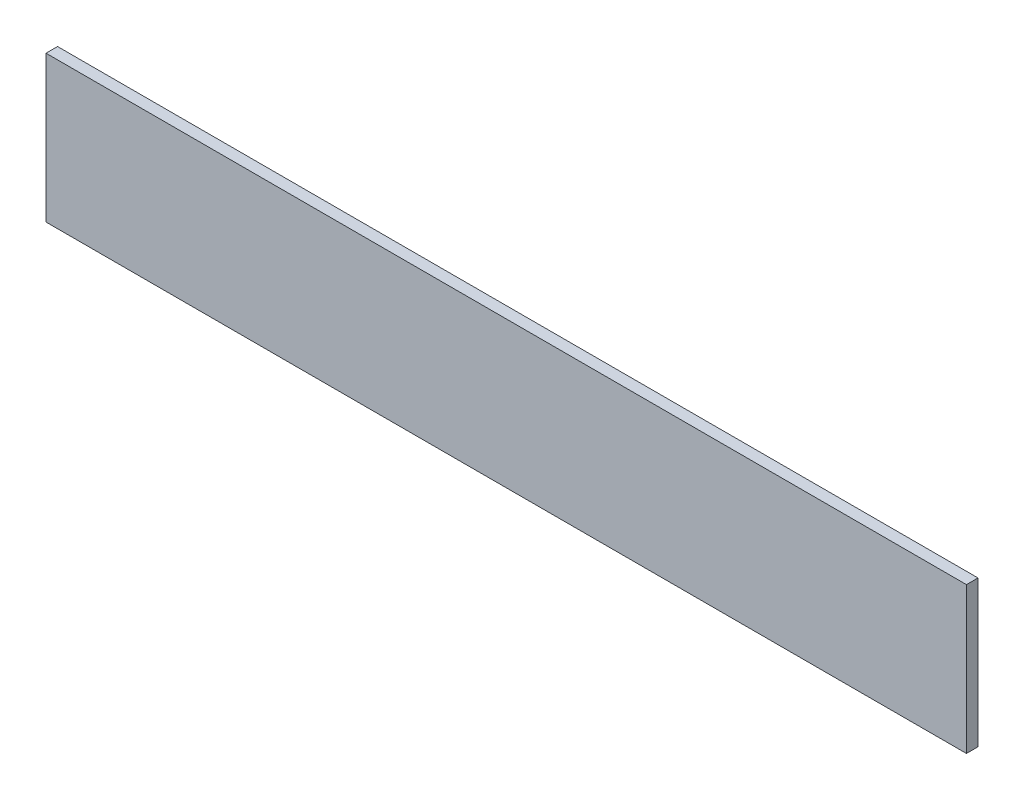
ISO-10303-21;
HEADER;
FILE_DESCRIPTION(('STEP AP214'),'2;1');
FILE_NAME('part.step','',(''),(''),'','','');
FILE_SCHEMA(('AUTOMOTIVE_DESIGN { 1 0 10303 214 1 1 1 1 }'));
ENDSEC;
DATA;
#1=APPLICATION_CONTEXT('core data for automotive mechanical design processes');
#2=APPLICATION_PROTOCOL_DEFINITION('international standard','automotive_design',2000,#1);
#3=PRODUCT_CONTEXT('',#1,'mechanical');
#4=PRODUCT('Part','Part','',(#3));
#5=PRODUCT_RELATED_PRODUCT_CATEGORY('part','',(#4));
#6=PRODUCT_DEFINITION_FORMATION('','',#4);
#7=PRODUCT_DEFINITION_CONTEXT('part definition',#1,'design');
#8=PRODUCT_DEFINITION('design','',#6,#7);
#9=PRODUCT_DEFINITION_SHAPE('','',#8);
#10=(LENGTH_UNIT() NAMED_UNIT(*) SI_UNIT(.MILLI.,.METRE.));
#11=(NAMED_UNIT(*) PLANE_ANGLE_UNIT() SI_UNIT($,.RADIAN.));
#12=(NAMED_UNIT(*) SI_UNIT($,.STERADIAN.) SOLID_ANGLE_UNIT());
#13=UNCERTAINTY_MEASURE_WITH_UNIT(LENGTH_MEASURE(1.E-05),#10,'distance_accuracy_value','');
#14=(GEOMETRIC_REPRESENTATION_CONTEXT(3) GLOBAL_UNCERTAINTY_ASSIGNED_CONTEXT((#13)) GLOBAL_UNIT_ASSIGNED_CONTEXT((#10,
#11,#12)) REPRESENTATION_CONTEXT('',''));
#15=CARTESIAN_POINT('',(0.,0.,0.));
#16=DIRECTION('',(0.,0.,1.));
#17=DIRECTION('',(1.,0.,0.));
#18=AXIS2_PLACEMENT_3D('',#15,#16,#17);
#19=CARTESIAN_POINT('',(-16.11,9.67288461538461,-11.2));
#20=DIRECTION('',(-1.,0.,0.));
#21=DIRECTION('',(0.,-1.,0.));
#22=AXIS2_PLACEMENT_3D('',#19,#20,#21);
#23=PLANE('',#22);
#24=DIRECTION('',(0.,-1.,0.));
#25=VECTOR('',#24,1.);
#26=CARTESIAN_POINT('',(-16.11,9.67288461538461,0.));
#27=LINE('',#26,#25);
#28=CARTESIAN_POINT('',(-16.11,9.67288461538461,0.));
#29=VERTEX_POINT('',#28);
#30=CARTESIAN_POINT('',(-16.11,-132.059115384615,0.));
#31=VERTEX_POINT('',#30);
#32=EDGE_CURVE('E113',#29,#31,#27,.T.);
#33=ORIENTED_EDGE('',*,*,#32,.F.);
#34=DIRECTION('',(0.,0.,1.));
#35=VECTOR('',#34,1.);
#36=CARTESIAN_POINT('',(-16.11,9.67288461538461,-11.2));
#37=LINE('',#36,#35);
#38=CARTESIAN_POINT('',(-16.11,9.67288461538461,-11.2));
#39=VERTEX_POINT('',#38);
#40=EDGE_CURVE('E11',#39,#29,#37,.T.);
#41=ORIENTED_EDGE('',*,*,#40,.F.);
#42=DIRECTION('',(0.,-1.,0.));
#43=VECTOR('',#42,1.);
#44=CARTESIAN_POINT('',(-16.11,9.67288461538461,-11.2));
#45=LINE('',#44,#43);
#46=CARTESIAN_POINT('',(-16.11,-132.059115384615,-11.2));
#47=VERTEX_POINT('',#46);
#48=EDGE_CURVE('E105',#39,#47,#45,.T.);
#49=ORIENTED_EDGE('',*,*,#48,.T.);
#50=DIRECTION('',(0.,0.,1.));
#51=VECTOR('',#50,1.);
#52=CARTESIAN_POINT('',(-16.11,-132.059115384615,-11.2));
#53=LINE('',#52,#51);
#54=EDGE_CURVE('E46',#47,#31,#53,.T.);
#55=ORIENTED_EDGE('',*,*,#54,.T.);
#56=EDGE_LOOP('',(#33,#41,#49,#55));
#57=FACE_BOUND('',#56,.T.);
#58=ADVANCED_FACE('F43',(#57),#23,.T.);
#59=CARTESIAN_POINT('',(-16.11,9.67288461538461,-11.2));
#60=DIRECTION('',(0.,1.,0.));
#61=DIRECTION('',(0.,0.,1.));
#62=AXIS2_PLACEMENT_3D('',#59,#60,#61);
#63=PLANE('',#62);
#64=DIRECTION('',(-1.,0.,0.));
#65=VECTOR('',#64,1.);
#66=CARTESIAN_POINT('',(-16.11,9.67288461538461,0.));
#67=LINE('',#66,#65);
#68=CARTESIAN_POINT('',(875.89,9.67288461538461,0.));
#69=VERTEX_POINT('',#68);
#70=EDGE_CURVE('E108',#69,#29,#67,.T.);
#71=ORIENTED_EDGE('',*,*,#70,.F.);
#72=DIRECTION('',(0.,0.,1.));
#73=VECTOR('',#72,1.);
#74=CARTESIAN_POINT('',(875.89,9.67288461538461,-11.2));
#75=LINE('',#74,#73);
#76=CARTESIAN_POINT('',(875.89,9.67288461538461,-11.2));
#77=VERTEX_POINT('',#76);
#78=EDGE_CURVE('E53',#77,#69,#75,.T.);
#79=ORIENTED_EDGE('',*,*,#78,.F.);
#80=DIRECTION('',(-1.,0.,0.));
#81=VECTOR('',#80,1.);
#82=CARTESIAN_POINT('',(-16.11,9.67288461538461,-11.2));
#83=LINE('',#82,#81);
#84=EDGE_CURVE('E100',#77,#39,#83,.T.);
#85=ORIENTED_EDGE('',*,*,#84,.T.);
#86=ORIENTED_EDGE('',*,*,#40,.T.);
#87=EDGE_LOOP('',(#71,#79,#85,#86));
#88=FACE_BOUND('',#87,.T.);
#89=ADVANCED_FACE('F129',(#88),#63,.T.);
#90=CARTESIAN_POINT('',(875.89,9.67288461538461,-11.2));
#91=DIRECTION('',(1.,0.,0.));
#92=DIRECTION('',(0.,0.,-1.));
#93=AXIS2_PLACEMENT_3D('',#90,#91,#92);
#94=PLANE('',#93);
#95=DIRECTION('',(0.,1.,0.));
#96=VECTOR('',#95,1.);
#97=CARTESIAN_POINT('',(875.89,9.67288461538461,0.));
#98=LINE('',#97,#96);
#99=CARTESIAN_POINT('',(875.89,-132.059115384615,0.));
#100=VERTEX_POINT('',#99);
#101=EDGE_CURVE('E94',#100,#69,#98,.T.);
#102=ORIENTED_EDGE('',*,*,#101,.F.);
#103=DIRECTION('',(0.,0.,1.));
#104=VECTOR('',#103,1.);
#105=CARTESIAN_POINT('',(875.89,-132.059115384615,-11.2));
#106=LINE('',#105,#104);
#107=CARTESIAN_POINT('',(875.89,-132.059115384615,-11.2));
#108=VERTEX_POINT('',#107);
#109=EDGE_CURVE('E89',#108,#100,#106,.T.);
#110=ORIENTED_EDGE('',*,*,#109,.F.);
#111=DIRECTION('',(0.,1.,0.));
#112=VECTOR('',#111,1.);
#113=CARTESIAN_POINT('',(875.89,9.67288461538461,-11.2));
#114=LINE('',#113,#112);
#115=EDGE_CURVE('E92',#108,#77,#114,.T.);
#116=ORIENTED_EDGE('',*,*,#115,.T.);
#117=ORIENTED_EDGE('',*,*,#78,.T.);
#118=EDGE_LOOP('',(#102,#110,#116,#117));
#119=FACE_BOUND('',#118,.T.);
#120=ADVANCED_FACE('F91',(#119),#94,.T.);
#121=CARTESIAN_POINT('',(-16.11,-132.059115384615,-11.2));
#122=DIRECTION('',(0.,-1.,0.));
#123=DIRECTION('',(0.,0.,-1.));
#124=AXIS2_PLACEMENT_3D('',#121,#122,#123);
#125=PLANE('',#124);
#126=DIRECTION('',(1.,0.,0.));
#127=VECTOR('',#126,1.);
#128=CARTESIAN_POINT('',(-16.11,-132.059115384615,0.));
#129=LINE('',#128,#127);
#130=EDGE_CURVE('E117',#31,#100,#129,.T.);
#131=ORIENTED_EDGE('',*,*,#130,.F.);
#132=ORIENTED_EDGE('',*,*,#54,.F.);
#133=DIRECTION('',(1.,0.,0.));
#134=VECTOR('',#133,1.);
#135=CARTESIAN_POINT('',(-16.11,-132.059115384615,-11.2));
#136=LINE('',#135,#134);
#137=EDGE_CURVE('E99',#47,#108,#136,.T.);
#138=ORIENTED_EDGE('',*,*,#137,.T.);
#139=ORIENTED_EDGE('',*,*,#109,.T.);
#140=EDGE_LOOP('',(#131,#132,#138,#139));
#141=FACE_BOUND('',#140,.T.);
#142=ADVANCED_FACE('F103',(#141),#125,.T.);
#143=CARTESIAN_POINT('',(0.,0.,-11.2));
#144=DIRECTION('',(0.,0.,1.));
#145=DIRECTION('',(1.,0.,0.));
#146=AXIS2_PLACEMENT_3D('',#143,#144,#145);
#147=PLANE('',#146);
#148=ORIENTED_EDGE('',*,*,#48,.F.);
#149=ORIENTED_EDGE('',*,*,#84,.F.);
#150=ORIENTED_EDGE('',*,*,#115,.F.);
#151=ORIENTED_EDGE('',*,*,#137,.F.);
#152=EDGE_LOOP('',(#148,#149,#150,#151));
#153=FACE_BOUND('',#152,.T.);
#154=ADVANCED_FACE('F98',(#153),#147,.F.);
#155=CARTESIAN_POINT('',(0.,0.,0.));
#156=DIRECTION('',(0.,0.,1.));
#157=DIRECTION('',(1.,0.,0.));
#158=AXIS2_PLACEMENT_3D('',#155,#156,#157);
#159=PLANE('',#158);
#160=ORIENTED_EDGE('',*,*,#32,.T.);
#161=ORIENTED_EDGE('',*,*,#130,.T.);
#162=ORIENTED_EDGE('',*,*,#101,.T.);
#163=ORIENTED_EDGE('',*,*,#70,.T.);
#164=EDGE_LOOP('',(#160,#161,#162,#163));
#165=FACE_BOUND('',#164,.T.);
#166=ADVANCED_FACE('F128',(#165),#159,.T.);
#167=CLOSED_SHELL('',(#58,#89,#120,#142,#154,#166));
#168=MANIFOLD_SOLID_BREP('B2',#167);
#169=ADVANCED_BREP_SHAPE_REPRESENTATION('',(#18,#168),#14);
#170=SHAPE_DEFINITION_REPRESENTATION(#9,#169);
ENDSEC;
END-ISO-10303-21;
